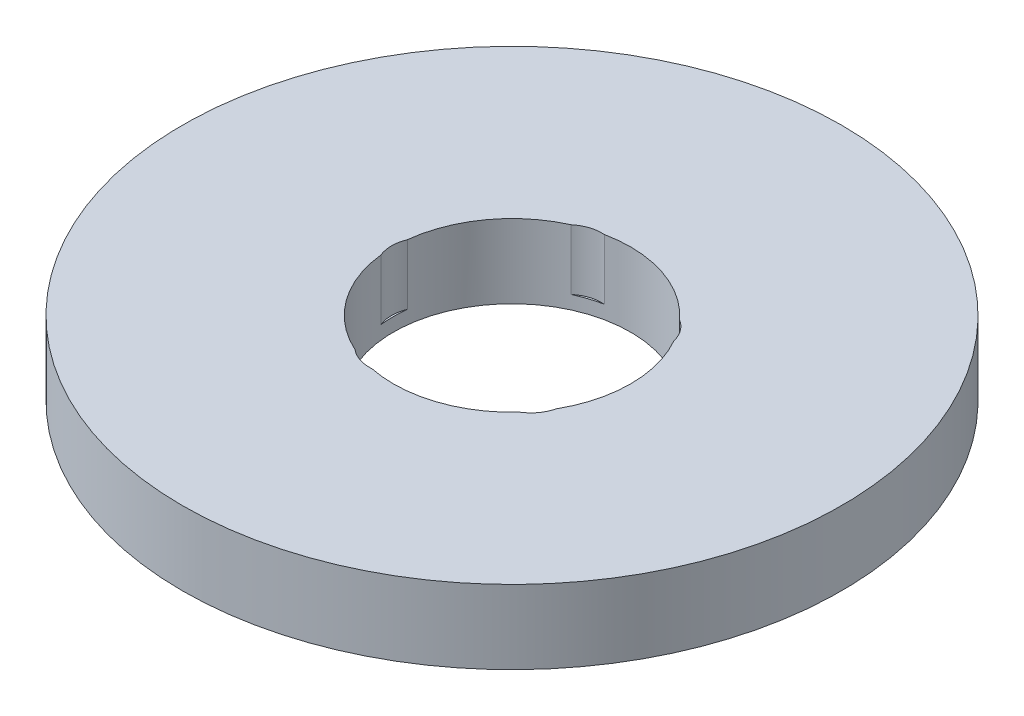
ISO-10303-21;
HEADER;
FILE_DESCRIPTION(('STEP AP214'),'2;1');
FILE_NAME('part.step','',(''),(''),'','','');
FILE_SCHEMA(('AUTOMOTIVE_DESIGN { 1 0 10303 214 1 1 1 1 }'));
ENDSEC;
DATA;
#1=APPLICATION_CONTEXT('core data for automotive mechanical design processes');
#2=APPLICATION_PROTOCOL_DEFINITION('international standard','automotive_design',2000,#1);
#3=PRODUCT_CONTEXT('',#1,'mechanical');
#4=PRODUCT('Part','Part','',(#3));
#5=PRODUCT_RELATED_PRODUCT_CATEGORY('part','',(#4));
#6=PRODUCT_DEFINITION_FORMATION('','',#4);
#7=PRODUCT_DEFINITION_CONTEXT('part definition',#1,'design');
#8=PRODUCT_DEFINITION('design','',#6,#7);
#9=PRODUCT_DEFINITION_SHAPE('','',#8);
#10=(LENGTH_UNIT() NAMED_UNIT(*) SI_UNIT(.MILLI.,.METRE.));
#11=(NAMED_UNIT(*) PLANE_ANGLE_UNIT() SI_UNIT($,.RADIAN.));
#12=(NAMED_UNIT(*) SI_UNIT($,.STERADIAN.) SOLID_ANGLE_UNIT());
#13=UNCERTAINTY_MEASURE_WITH_UNIT(LENGTH_MEASURE(1.E-05),#10,'distance_accuracy_value','');
#14=(GEOMETRIC_REPRESENTATION_CONTEXT(3) GLOBAL_UNCERTAINTY_ASSIGNED_CONTEXT((#13)) GLOBAL_UNIT_ASSIGNED_CONTEXT((#10,
#11,#12)) REPRESENTATION_CONTEXT('',''));
#15=CARTESIAN_POINT('',(0.,0.,0.));
#16=DIRECTION('',(0.,0.,1.));
#17=DIRECTION('',(1.,0.,0.));
#18=AXIS2_PLACEMENT_3D('',#15,#16,#17);
#19=CARTESIAN_POINT('',(0.,14.,0.));
#20=DIRECTION('',(0.,-1.,0.));
#21=DIRECTION('',(0.,0.,-1.));
#22=AXIS2_PLACEMENT_3D('',#19,#20,#21);
#23=CYLINDRICAL_SURFACE('',#22,62.5);
#24=CARTESIAN_POINT('',(0.,14.,0.));
#25=DIRECTION('',(0.,1.,0.));
#26=DIRECTION('',(0.,0.,1.));
#27=AXIS2_PLACEMENT_3D('',#24,#25,#26);
#28=CIRCLE('',#27,62.5);
#29=CARTESIAN_POINT('',(0.,14.,62.5));
#30=VERTEX_POINT('',#29);
#31=EDGE_CURVE('E151',#30,#30,#28,.T.);
#32=ORIENTED_EDGE('',*,*,#31,.F.);
#33=EDGE_LOOP('',(#32));
#34=FACE_BOUND('',#33,.T.);
#35=CARTESIAN_POINT('',(0.,0.,0.));
#36=DIRECTION('',(0.,1.,0.));
#37=DIRECTION('',(0.,0.,1.));
#38=AXIS2_PLACEMENT_3D('',#35,#36,#37);
#39=CIRCLE('',#38,62.5);
#40=CARTESIAN_POINT('',(0.,0.,62.5));
#41=VERTEX_POINT('',#40);
#42=EDGE_CURVE('E150',#41,#41,#39,.T.);
#43=ORIENTED_EDGE('',*,*,#42,.T.);
#44=EDGE_LOOP('',(#43));
#45=FACE_BOUND('',#44,.T.);
#46=ADVANCED_FACE('F39',(#34,#45),#23,.T.);
#47=CARTESIAN_POINT('',(0.,14.,0.));
#48=DIRECTION('',(0.,1.,0.));
#49=DIRECTION('',(0.,0.,1.));
#50=AXIS2_PLACEMENT_3D('',#47,#48,#49);
#51=PLANE('',#50);
#52=CARTESIAN_POINT('',(-5.00921706474307,14.,-15.4167848942965));
#53=DIRECTION('',(0.,1.,0.));
#54=DIRECTION('',(-0.95105651629515,0.,0.309016994374958));
#55=AXIS2_PLACEMENT_3D('',#52,#53,#54);
#56=CIRCLE('',#55,6.64018826694914);
#57=CARTESIAN_POINT('',(-4.52857706904039,14.,-22.0395551164211));
#58=VERTEX_POINT('',#57);
#59=CARTESIAN_POINT('',(-9.29082965532952,14.,-20.4922054526996));
#60=VERTEX_POINT('',#59);
#61=EDGE_CURVE('E196',#58,#60,#56,.T.);
#62=ORIENTED_EDGE('',*,*,#61,.F.);
#63=CARTESIAN_POINT('',(0.,14.,0.));
#64=DIRECTION('',(0.,1.,0.));
#65=DIRECTION('',(0.,0.,1.));
#66=AXIS2_PLACEMENT_3D('',#63,#64,#65);
#67=CIRCLE('',#66,22.5);
#68=CARTESIAN_POINT('',(16.6182212737095,14.,-15.1685438225965));
#69=VERTEX_POINT('',#68);
#70=EDGE_CURVE('E156',#69,#58,#67,.T.);
#71=ORIENTED_EDGE('',*,*,#70,.F.);
#72=CARTESIAN_POINT('',(13.1143005325228,14.,-9.52809706192133));
#73=DIRECTION('',(0.,1.,0.));
#74=DIRECTION('',(-0.58778525229248,0.,-0.809016994374942));
#75=AXIS2_PLACEMENT_3D('',#72,#73,#74);
#76=CIRCLE('',#75,6.64018826694914);
#77=CARTESIAN_POINT('',(19.5614552350483,14.,-11.1175298104931));
#78=VERTEX_POINT('',#77);
#79=EDGE_CURVE('E254',#78,#69,#76,.T.);
#80=ORIENTED_EDGE('',*,*,#79,.F.);
#81=CARTESIAN_POINT('',(19.5614552350485,14.,11.1175298104928));
#82=VERTEX_POINT('',#81);
#83=EDGE_CURVE('E153',#82,#78,#67,.T.);
#84=ORIENTED_EDGE('',*,*,#83,.F.);
#85=CARTESIAN_POINT('',(13.1143005325229,14.,9.52809706192114));
#86=DIRECTION('',(0.,1.,0.));
#87=DIRECTION('',(0.587785252292469,0.,-0.809016994374951));
#88=AXIS2_PLACEMENT_3D('',#85,#86,#87);
#89=CIRCLE('',#88,6.64018826694914);
#90=CARTESIAN_POINT('',(16.6182212737097,14.,15.1685438225962));
#91=VERTEX_POINT('',#90);
#92=EDGE_CURVE('E248',#91,#82,#89,.T.);
#93=ORIENTED_EDGE('',*,*,#92,.F.);
#94=CARTESIAN_POINT('',(-4.52857706904007,14.,22.0395551164211));
#95=VERTEX_POINT('',#94);
#96=EDGE_CURVE('E140',#95,#91,#67,.T.);
#97=ORIENTED_EDGE('',*,*,#96,.F.);
#98=CARTESIAN_POINT('',(-5.00921706474285,14.,15.4167848942966));
#99=DIRECTION('',(0.,1.,0.));
#100=DIRECTION('',(0.951056516295155,0.,0.309016994374945));
#101=AXIS2_PLACEMENT_3D('',#98,#99,#100);
#102=CIRCLE('',#101,6.64018826694914);
#103=CARTESIAN_POINT('',(-9.29082965532924,14.,20.4922054526997));
#104=VERTEX_POINT('',#103);
#105=EDGE_CURVE('E117',#104,#95,#102,.T.);
#106=ORIENTED_EDGE('',*,*,#105,.F.);
#107=CARTESIAN_POINT('',(-22.3602697843886,14.,2.50366434838201));
#108=VERTEX_POINT('',#107);
#109=EDGE_CURVE('E133',#108,#104,#67,.T.);
#110=ORIENTED_EDGE('',*,*,#109,.F.);
#111=CARTESIAN_POINT('',(-16.21016693556,14.,0.));
#112=DIRECTION('',(0.,1.,0.));
#113=DIRECTION('',(0.,0.,1.));
#114=AXIS2_PLACEMENT_3D('',#111,#112,#113);
#115=CIRCLE('',#114,6.64018826694914);
#116=CARTESIAN_POINT('',(-22.3602697843886,14.,-2.50366434838201));
#117=VERTEX_POINT('',#116);
#118=EDGE_CURVE('E170',#117,#108,#115,.T.);
#119=ORIENTED_EDGE('',*,*,#118,.F.);
#120=EDGE_CURVE('E149',#60,#117,#67,.T.);
#121=ORIENTED_EDGE('',*,*,#120,.F.);
#122=EDGE_LOOP('',(#62,#71,#80,#84,#93,#97,#106,#110,#119,#121));
#123=FACE_BOUND('',#122,.T.);
#124=ORIENTED_EDGE('',*,*,#31,.T.);
#125=EDGE_LOOP('',(#124));
#126=FACE_BOUND('',#125,.T.);
#127=ADVANCED_FACE('F131',(#123,#126),#51,.T.);
#128=CARTESIAN_POINT('',(0.,0.,0.));
#129=DIRECTION('',(0.,1.,0.));
#130=DIRECTION('',(0.,0.,1.));
#131=AXIS2_PLACEMENT_3D('',#128,#129,#130);
#132=PLANE('',#131);
#133=CARTESIAN_POINT('',(0.,0.,0.));
#134=DIRECTION('',(0.,1.,0.));
#135=DIRECTION('',(0.,0.,1.));
#136=AXIS2_PLACEMENT_3D('',#133,#134,#135);
#137=CIRCLE('',#136,22.5);
#138=CARTESIAN_POINT('',(0.,0.,22.5));
#139=VERTEX_POINT('',#138);
#140=EDGE_CURVE('E160',#139,#139,#137,.T.);
#141=ORIENTED_EDGE('',*,*,#140,.T.);
#142=EDGE_LOOP('',(#141));
#143=FACE_BOUND('',#142,.T.);
#144=ORIENTED_EDGE('',*,*,#42,.F.);
#145=EDGE_LOOP('',(#144));
#146=FACE_BOUND('',#145,.T.);
#147=ADVANCED_FACE('F212',(#143,#146),#132,.F.);
#148=CARTESIAN_POINT('',(0.,14.,0.));
#149=DIRECTION('',(0.,-1.,0.));
#150=DIRECTION('',(0.,0.,-1.));
#151=AXIS2_PLACEMENT_3D('',#148,#149,#150);
#152=CYLINDRICAL_SURFACE('',#151,22.5);
#153=DIRECTION('',(0.,1.,0.));
#154=VECTOR('',#153,1.);
#155=CARTESIAN_POINT('',(-4.52857706904042,8.27602121323602,-22.0395551164211));
#156=LINE('',#155,#154);
#157=CARTESIAN_POINT('',(-4.52857706904039,2.55204242647203,-22.0395551164211));
#158=VERTEX_POINT('',#157);
#159=EDGE_CURVE('E11',#158,#58,#156,.T.);
#160=ORIENTED_EDGE('',*,*,#159,.F.);
#161=CARTESIAN_POINT('',(0.,2.55204242647203,0.));
#162=DIRECTION('',(0.,1.,0.));
#163=DIRECTION('',(0.,0.,1.));
#164=AXIS2_PLACEMENT_3D('',#161,#162,#163);
#165=CIRCLE('',#164,22.5);
#166=CARTESIAN_POINT('',(-9.29082965532952,2.55204242647203,-20.4922054526996));
#167=VERTEX_POINT('',#166);
#168=EDGE_CURVE('E193',#158,#167,#165,.T.);
#169=ORIENTED_EDGE('',*,*,#168,.T.);
#170=DIRECTION('',(0.,1.,0.));
#171=VECTOR('',#170,1.);
#172=CARTESIAN_POINT('',(-9.2908296553295,8.27602121323602,-20.4922054526996));
#173=LINE('',#172,#171);
#174=EDGE_CURVE('E46',#60,#167,#173,.F.);
#175=ORIENTED_EDGE('',*,*,#174,.F.);
#176=ORIENTED_EDGE('',*,*,#120,.T.);
#177=DIRECTION('',(0.,1.,0.));
#178=VECTOR('',#177,1.);
#179=CARTESIAN_POINT('',(-22.3602697843886,8.27602121323602,-2.50366434838199));
#180=LINE('',#179,#178);
#181=CARTESIAN_POINT('',(-22.3602697843886,2.55204242647203,-2.50366434838201));
#182=VERTEX_POINT('',#181);
#183=EDGE_CURVE('E174',#182,#117,#180,.T.);
#184=ORIENTED_EDGE('',*,*,#183,.F.);
#185=CARTESIAN_POINT('',(0.,2.55204242647203,0.));
#186=DIRECTION('',(0.,1.,0.));
#187=DIRECTION('',(0.,0.,1.));
#188=AXIS2_PLACEMENT_3D('',#185,#186,#187);
#189=CIRCLE('',#188,22.5);
#190=CARTESIAN_POINT('',(-22.3602697843886,2.55204242647203,2.50366434838201));
#191=VERTEX_POINT('',#190);
#192=EDGE_CURVE('E171',#182,#191,#189,.T.);
#193=ORIENTED_EDGE('',*,*,#192,.T.);
#194=DIRECTION('',(0.,1.,0.));
#195=VECTOR('',#194,1.);
#196=CARTESIAN_POINT('',(-22.3602697843886,8.27602121323602,2.50366434838199));
#197=LINE('',#196,#195);
#198=EDGE_CURVE('E148',#108,#191,#197,.F.);
#199=ORIENTED_EDGE('',*,*,#198,.F.);
#200=ORIENTED_EDGE('',*,*,#109,.T.);
#201=DIRECTION('',(0.,1.,0.));
#202=VECTOR('',#201,1.);
#203=CARTESIAN_POINT('',(-9.29082965532922,8.27602121323602,20.4922054526997));
#204=LINE('',#203,#202);
#205=CARTESIAN_POINT('',(-9.29082965532924,2.55204242647203,20.4922054526997));
#206=VERTEX_POINT('',#205);
#207=EDGE_CURVE('E111',#206,#104,#204,.T.);
#208=ORIENTED_EDGE('',*,*,#207,.F.);
#209=CARTESIAN_POINT('',(0.,2.55204242647203,0.));
#210=DIRECTION('',(0.,1.,0.));
#211=DIRECTION('',(0.,0.,1.));
#212=AXIS2_PLACEMENT_3D('',#209,#210,#211);
#213=CIRCLE('',#212,22.5);
#214=CARTESIAN_POINT('',(-4.52857706904007,2.55204242647203,22.0395551164211));
#215=VERTEX_POINT('',#214);
#216=EDGE_CURVE('E180',#206,#215,#213,.T.);
#217=ORIENTED_EDGE('',*,*,#216,.T.);
#218=DIRECTION('',(0.,1.,0.));
#219=VECTOR('',#218,1.);
#220=CARTESIAN_POINT('',(-4.52857706904008,8.27602121323602,22.0395551164211));
#221=LINE('',#220,#219);
#222=EDGE_CURVE('E124',#95,#215,#221,.F.);
#223=ORIENTED_EDGE('',*,*,#222,.F.);
#224=ORIENTED_EDGE('',*,*,#96,.T.);
#225=DIRECTION('',(0.,1.,0.));
#226=VECTOR('',#225,1.);
#227=CARTESIAN_POINT('',(16.6182212737097,8.27602121323602,15.1685438225962));
#228=LINE('',#227,#226);
#229=CARTESIAN_POINT('',(16.6182212737097,2.55204242647203,15.1685438225962));
#230=VERTEX_POINT('',#229);
#231=EDGE_CURVE('E183',#230,#91,#228,.T.);
#232=ORIENTED_EDGE('',*,*,#231,.F.);
#233=CARTESIAN_POINT('',(0.,2.55204242647203,0.));
#234=DIRECTION('',(0.,1.,0.));
#235=DIRECTION('',(0.,0.,1.));
#236=AXIS2_PLACEMENT_3D('',#233,#234,#235);
#237=CIRCLE('',#236,22.5);
#238=CARTESIAN_POINT('',(19.5614552350485,2.55204242647203,11.1175298104928));
#239=VERTEX_POINT('',#238);
#240=EDGE_CURVE('E123',#230,#239,#237,.T.);
#241=ORIENTED_EDGE('',*,*,#240,.T.);
#242=DIRECTION('',(0.,1.,0.));
#243=VECTOR('',#242,1.);
#244=CARTESIAN_POINT('',(19.5614552350485,8.27602121323602,11.1175298104928));
#245=LINE('',#244,#243);
#246=EDGE_CURVE('E185',#82,#239,#245,.F.);
#247=ORIENTED_EDGE('',*,*,#246,.F.);
#248=ORIENTED_EDGE('',*,*,#83,.T.);
#249=DIRECTION('',(0.,1.,0.));
#250=VECTOR('',#249,1.);
#251=CARTESIAN_POINT('',(19.5614552350483,8.27602121323602,-11.1175298104931));
#252=LINE('',#251,#250);
#253=CARTESIAN_POINT('',(19.5614552350483,2.55204242647203,-11.1175298104931));
#254=VERTEX_POINT('',#253);
#255=EDGE_CURVE('E195',#254,#78,#252,.T.);
#256=ORIENTED_EDGE('',*,*,#255,.F.);
#257=CARTESIAN_POINT('',(0.,2.55204242647203,0.));
#258=DIRECTION('',(0.,1.,0.));
#259=DIRECTION('',(0.,0.,1.));
#260=AXIS2_PLACEMENT_3D('',#257,#258,#259);
#261=CIRCLE('',#260,22.5);
#262=CARTESIAN_POINT('',(16.6182212737095,2.55204242647203,-15.1685438225965));
#263=VERTEX_POINT('',#262);
#264=EDGE_CURVE('E190',#254,#263,#261,.T.);
#265=ORIENTED_EDGE('',*,*,#264,.T.);
#266=DIRECTION('',(0.,1.,0.));
#267=VECTOR('',#266,1.);
#268=CARTESIAN_POINT('',(16.6182212737095,8.27602121323602,-15.1685438225965));
#269=LINE('',#268,#267);
#270=EDGE_CURVE('E189',#69,#263,#269,.F.);
#271=ORIENTED_EDGE('',*,*,#270,.F.);
#272=ORIENTED_EDGE('',*,*,#70,.T.);
#273=EDGE_LOOP('',(#160,#169,#175,#176,#184,#193,#199,#200,#208,#217,#223,#224,#232,#241,#247,
#248,#256,#265,#271,#272));
#274=FACE_BOUND('',#273,.T.);
#275=ORIENTED_EDGE('',*,*,#140,.F.);
#276=EDGE_LOOP('',(#275));
#277=FACE_BOUND('',#276,.T.);
#278=ADVANCED_FACE('F142',(#274,#277),#152,.F.);
#279=CARTESIAN_POINT('',(-16.21016693556,2.55204242647203,0.));
#280=DIRECTION('',(0.,1.,0.));
#281=DIRECTION('',(0.,0.,1.));
#282=AXIS2_PLACEMENT_3D('',#279,#280,#281);
#283=CYLINDRICAL_SURFACE('',#282,6.64018826694914);
#284=ORIENTED_EDGE('',*,*,#183,.T.);
#285=ORIENTED_EDGE('',*,*,#118,.T.);
#286=ORIENTED_EDGE('',*,*,#198,.T.);
#287=CARTESIAN_POINT('',(-16.21016693556,2.55204242647203,0.));
#288=DIRECTION('',(0.,1.,0.));
#289=DIRECTION('',(0.,0.,1.));
#290=AXIS2_PLACEMENT_3D('',#287,#288,#289);
#291=CIRCLE('',#290,6.64018826694914);
#292=EDGE_CURVE('E163',#182,#191,#291,.T.);
#293=ORIENTED_EDGE('',*,*,#292,.F.);
#294=EDGE_LOOP('',(#284,#285,#286,#293));
#295=FACE_BOUND('',#294,.T.);
#296=ADVANCED_FACE('F221',(#295),#283,.F.);
#297=CARTESIAN_POINT('',(-16.21016693556,2.55204242647203,0.));
#298=DIRECTION('',(0.,1.,0.));
#299=DIRECTION('',(0.,0.,1.));
#300=AXIS2_PLACEMENT_3D('',#297,#298,#299);
#301=PLANE('',#300);
#302=ORIENTED_EDGE('',*,*,#292,.T.);
#303=ORIENTED_EDGE('',*,*,#192,.F.);
#304=EDGE_LOOP('',(#302,#303));
#305=FACE_BOUND('',#304,.T.);
#306=ADVANCED_FACE('F227',(#305),#301,.T.);
#307=CARTESIAN_POINT('',(-5.00921706474285,2.55204242647203,15.4167848942966));
#308=DIRECTION('',(0.,1.,0.));
#309=DIRECTION('',(0.,0.,1.));
#310=AXIS2_PLACEMENT_3D('',#307,#308,#309);
#311=CYLINDRICAL_SURFACE('',#310,6.64018826694914);
#312=ORIENTED_EDGE('',*,*,#207,.T.);
#313=ORIENTED_EDGE('',*,*,#105,.T.);
#314=ORIENTED_EDGE('',*,*,#222,.T.);
#315=CARTESIAN_POINT('',(-5.00921706474285,2.55204242647203,15.4167848942966));
#316=DIRECTION('',(0.,1.,0.));
#317=DIRECTION('',(0.951056516295155,0.,0.309016994374945));
#318=AXIS2_PLACEMENT_3D('',#315,#316,#317);
#319=CIRCLE('',#318,6.64018826694914);
#320=EDGE_CURVE('E119',#206,#215,#319,.T.);
#321=ORIENTED_EDGE('',*,*,#320,.F.);
#322=EDGE_LOOP('',(#312,#313,#314,#321));
#323=FACE_BOUND('',#322,.T.);
#324=ADVANCED_FACE('F116',(#323),#311,.F.);
#325=CARTESIAN_POINT('',(-5.00921706474285,2.55204242647203,15.4167848942966));
#326=DIRECTION('',(0.,1.,0.));
#327=DIRECTION('',(0.951056516295155,0.,0.309016994374945));
#328=AXIS2_PLACEMENT_3D('',#325,#326,#327);
#329=PLANE('',#328);
#330=ORIENTED_EDGE('',*,*,#320,.T.);
#331=ORIENTED_EDGE('',*,*,#216,.F.);
#332=EDGE_LOOP('',(#330,#331));
#333=FACE_BOUND('',#332,.T.);
#334=ADVANCED_FACE('F234',(#333),#329,.T.);
#335=CARTESIAN_POINT('',(13.1143005325229,2.55204242647203,9.52809706192114));
#336=DIRECTION('',(0.,1.,0.));
#337=DIRECTION('',(0.,0.,1.));
#338=AXIS2_PLACEMENT_3D('',#335,#336,#337);
#339=CYLINDRICAL_SURFACE('',#338,6.64018826694914);
#340=ORIENTED_EDGE('',*,*,#231,.T.);
#341=ORIENTED_EDGE('',*,*,#92,.T.);
#342=ORIENTED_EDGE('',*,*,#246,.T.);
#343=CARTESIAN_POINT('',(13.1143005325229,2.55204242647203,9.52809706192114));
#344=DIRECTION('',(0.,1.,0.));
#345=DIRECTION('',(0.587785252292469,0.,-0.809016994374951));
#346=AXIS2_PLACEMENT_3D('',#343,#344,#345);
#347=CIRCLE('',#346,6.64018826694914);
#348=EDGE_CURVE('E137',#230,#239,#347,.T.);
#349=ORIENTED_EDGE('',*,*,#348,.F.);
#350=EDGE_LOOP('',(#340,#341,#342,#349));
#351=FACE_BOUND('',#350,.T.);
#352=ADVANCED_FACE('F240',(#351),#339,.F.);
#353=CARTESIAN_POINT('',(13.1143005325229,2.55204242647203,9.52809706192114));
#354=DIRECTION('',(0.,1.,0.));
#355=DIRECTION('',(0.587785252292469,0.,-0.809016994374951));
#356=AXIS2_PLACEMENT_3D('',#353,#354,#355);
#357=PLANE('',#356);
#358=ORIENTED_EDGE('',*,*,#348,.T.);
#359=ORIENTED_EDGE('',*,*,#240,.F.);
#360=EDGE_LOOP('',(#358,#359));
#361=FACE_BOUND('',#360,.T.);
#362=ADVANCED_FACE('F245',(#361),#357,.T.);
#363=CARTESIAN_POINT('',(13.1143005325228,2.55204242647203,-9.52809706192133));
#364=DIRECTION('',(0.,1.,0.));
#365=DIRECTION('',(0.,0.,1.));
#366=AXIS2_PLACEMENT_3D('',#363,#364,#365);
#367=CYLINDRICAL_SURFACE('',#366,6.64018826694914);
#368=ORIENTED_EDGE('',*,*,#255,.T.);
#369=ORIENTED_EDGE('',*,*,#79,.T.);
#370=ORIENTED_EDGE('',*,*,#270,.T.);
#371=CARTESIAN_POINT('',(13.1143005325228,2.55204242647203,-9.52809706192133));
#372=DIRECTION('',(0.,1.,0.));
#373=DIRECTION('',(-0.58778525229248,0.,-0.809016994374942));
#374=AXIS2_PLACEMENT_3D('',#371,#372,#373);
#375=CIRCLE('',#374,6.64018826694914);
#376=EDGE_CURVE('E56',#254,#263,#375,.T.);
#377=ORIENTED_EDGE('',*,*,#376,.F.);
#378=EDGE_LOOP('',(#368,#369,#370,#377));
#379=FACE_BOUND('',#378,.T.);
#380=ADVANCED_FACE('F264',(#379),#367,.F.);
#381=CARTESIAN_POINT('',(13.1143005325228,2.55204242647203,-9.52809706192133));
#382=DIRECTION('',(0.,1.,0.));
#383=DIRECTION('',(-0.58778525229248,0.,-0.809016994374942));
#384=AXIS2_PLACEMENT_3D('',#381,#382,#383);
#385=PLANE('',#384);
#386=ORIENTED_EDGE('',*,*,#376,.T.);
#387=ORIENTED_EDGE('',*,*,#264,.F.);
#388=EDGE_LOOP('',(#386,#387));
#389=FACE_BOUND('',#388,.T.);
#390=ADVANCED_FACE('F202',(#389),#385,.T.);
#391=CARTESIAN_POINT('',(-5.00921706474307,2.55204242647203,-15.4167848942965));
#392=DIRECTION('',(0.,1.,0.));
#393=DIRECTION('',(0.,0.,1.));
#394=AXIS2_PLACEMENT_3D('',#391,#392,#393);
#395=CYLINDRICAL_SURFACE('',#394,6.64018826694914);
#396=ORIENTED_EDGE('',*,*,#159,.T.);
#397=ORIENTED_EDGE('',*,*,#61,.T.);
#398=ORIENTED_EDGE('',*,*,#174,.T.);
#399=CARTESIAN_POINT('',(-5.00921706474307,2.55204242647203,-15.4167848942965));
#400=DIRECTION('',(0.,1.,0.));
#401=DIRECTION('',(-0.95105651629515,0.,0.309016994374958));
#402=AXIS2_PLACEMENT_3D('',#399,#400,#401);
#403=CIRCLE('',#402,6.64018826694914);
#404=EDGE_CURVE('E55',#158,#167,#403,.T.);
#405=ORIENTED_EDGE('',*,*,#404,.F.);
#406=EDGE_LOOP('',(#396,#397,#398,#405));
#407=FACE_BOUND('',#406,.T.);
#408=ADVANCED_FACE('F197',(#407),#395,.F.);
#409=CARTESIAN_POINT('',(-5.00921706474307,2.55204242647203,-15.4167848942965));
#410=DIRECTION('',(0.,1.,0.));
#411=DIRECTION('',(-0.95105651629515,0.,0.309016994374958));
#412=AXIS2_PLACEMENT_3D('',#409,#410,#411);
#413=PLANE('',#412);
#414=ORIENTED_EDGE('',*,*,#404,.T.);
#415=ORIENTED_EDGE('',*,*,#168,.F.);
#416=EDGE_LOOP('',(#414,#415));
#417=FACE_BOUND('',#416,.T.);
#418=ADVANCED_FACE('F200',(#417),#413,.T.);
#419=CLOSED_SHELL('',(#46,#127,#147,#278,#296,#306,#324,#334,#352,#362,#380,#390,#408,#418));
#420=MANIFOLD_SOLID_BREP('B2',#419);
#421=ADVANCED_BREP_SHAPE_REPRESENTATION('',(#18,#420),#14);
#422=SHAPE_DEFINITION_REPRESENTATION(#9,#421);
ENDSEC;
END-ISO-10303-21;
